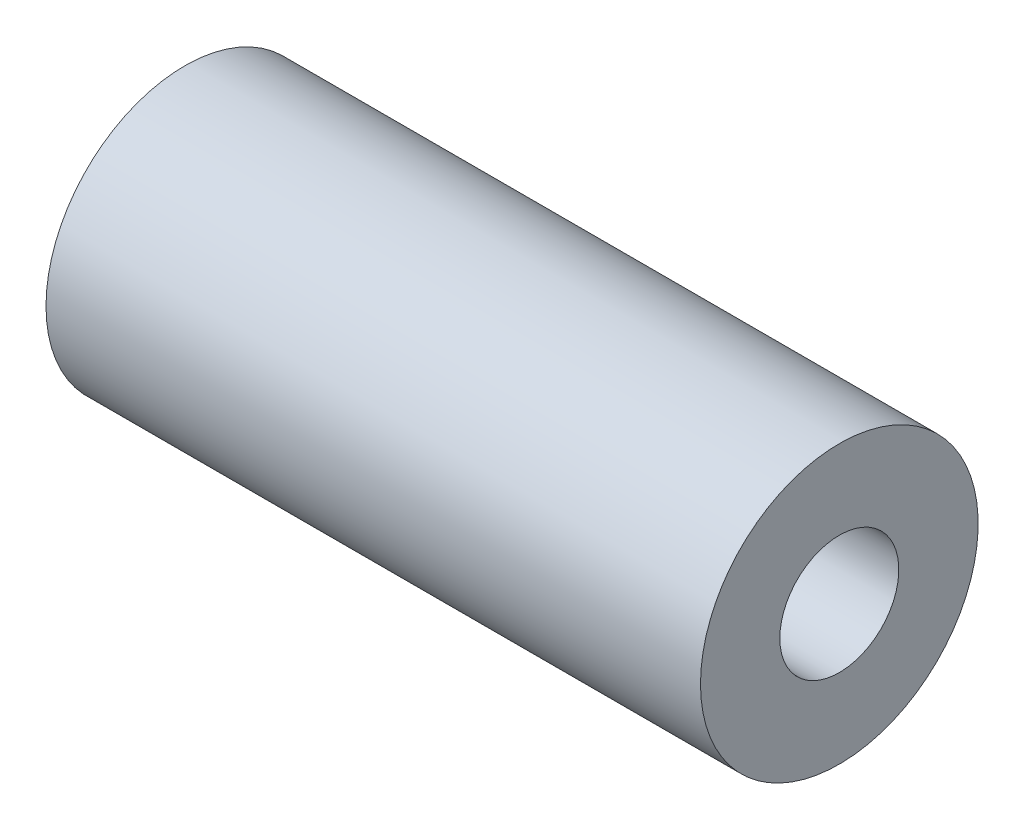
ISO-10303-21;
HEADER;
FILE_DESCRIPTION(('STEP AP214'),'2;1');
FILE_NAME('part.step','',(''),(''),'','','');
FILE_SCHEMA(('AUTOMOTIVE_DESIGN { 1 0 10303 214 1 1 1 1 }'));
ENDSEC;
DATA;
#1=APPLICATION_CONTEXT('core data for automotive mechanical design processes');
#2=APPLICATION_PROTOCOL_DEFINITION('international standard','automotive_design',2000,#1);
#3=PRODUCT_CONTEXT('',#1,'mechanical');
#4=PRODUCT('Part','Part','',(#3));
#5=PRODUCT_RELATED_PRODUCT_CATEGORY('part','',(#4));
#6=PRODUCT_DEFINITION_FORMATION('','',#4);
#7=PRODUCT_DEFINITION_CONTEXT('part definition',#1,'design');
#8=PRODUCT_DEFINITION('design','',#6,#7);
#9=PRODUCT_DEFINITION_SHAPE('','',#8);
#10=(LENGTH_UNIT() NAMED_UNIT(*) SI_UNIT(.MILLI.,.METRE.));
#11=(NAMED_UNIT(*) PLANE_ANGLE_UNIT() SI_UNIT($,.RADIAN.));
#12=(NAMED_UNIT(*) SI_UNIT($,.STERADIAN.) SOLID_ANGLE_UNIT());
#13=UNCERTAINTY_MEASURE_WITH_UNIT(LENGTH_MEASURE(1.E-05),#10,'distance_accuracy_value','');
#14=(GEOMETRIC_REPRESENTATION_CONTEXT(3) GLOBAL_UNCERTAINTY_ASSIGNED_CONTEXT((#13)) GLOBAL_UNIT_ASSIGNED_CONTEXT((#10,
#11,#12)) REPRESENTATION_CONTEXT('',''));
#15=CARTESIAN_POINT('',(0.,0.,0.));
#16=DIRECTION('',(0.,0.,1.));
#17=DIRECTION('',(1.,0.,0.));
#18=AXIS2_PLACEMENT_3D('',#15,#16,#17);
#19=CARTESIAN_POINT('',(-16.5,7.,0.));
#20=DIRECTION('',(1.,0.,0.));
#21=DIRECTION('',(0.,0.,-1.));
#22=AXIS2_PLACEMENT_3D('',#19,#20,#21);
#23=PLANE('',#22);
#24=CARTESIAN_POINT('',(-16.5,0.,0.));
#25=DIRECTION('',(-1.,0.,0.));
#26=DIRECTION('',(0.,0.,1.));
#27=AXIS2_PLACEMENT_3D('',#24,#25,#26);
#28=CIRCLE('',#27,3.);
#29=CARTESIAN_POINT('',(-16.5,0.,3.));
#30=VERTEX_POINT('',#29);
#31=EDGE_CURVE('E10',#30,#30,#28,.T.);
#32=ORIENTED_EDGE('',*,*,#31,.F.);
#33=EDGE_LOOP('',(#32));
#34=FACE_BOUND('',#33,.T.);
#35=CARTESIAN_POINT('',(-16.5,0.,0.));
#36=DIRECTION('',(-1.,0.,0.));
#37=DIRECTION('',(0.,0.,1.));
#38=AXIS2_PLACEMENT_3D('',#35,#36,#37);
#39=CIRCLE('',#38,7.);
#40=CARTESIAN_POINT('',(-16.5,0.,7.));
#41=VERTEX_POINT('',#40);
#42=EDGE_CURVE('E43',#41,#41,#39,.T.);
#43=ORIENTED_EDGE('',*,*,#42,.T.);
#44=EDGE_LOOP('',(#43));
#45=FACE_BOUND('',#44,.T.);
#46=ADVANCED_FACE('F29',(#34,#45),#23,.F.);
#47=CARTESIAN_POINT('',(-37.0031632185857,0.,0.));
#48=DIRECTION('',(-1.,0.,0.));
#49=DIRECTION('',(0.,0.,1.));
#50=AXIS2_PLACEMENT_3D('',#47,#48,#49);
#51=CYLINDRICAL_SURFACE('',#50,3.);
#52=CARTESIAN_POINT('',(16.5,0.,0.));
#53=DIRECTION('',(-1.,0.,0.));
#54=DIRECTION('',(0.,0.,1.));
#55=AXIS2_PLACEMENT_3D('',#52,#53,#54);
#56=CIRCLE('',#55,3.);
#57=CARTESIAN_POINT('',(16.5,0.,3.));
#58=VERTEX_POINT('',#57);
#59=EDGE_CURVE('E35',#58,#58,#56,.T.);
#60=ORIENTED_EDGE('',*,*,#59,.F.);
#61=EDGE_LOOP('',(#60));
#62=FACE_BOUND('',#61,.T.);
#63=ORIENTED_EDGE('',*,*,#31,.T.);
#64=EDGE_LOOP('',(#63));
#65=FACE_BOUND('',#64,.T.);
#66=ADVANCED_FACE('F58',(#62,#65),#51,.F.);
#67=CARTESIAN_POINT('',(16.5,7.,0.));
#68=DIRECTION('',(-1.,0.,0.));
#69=DIRECTION('',(0.,0.,1.));
#70=AXIS2_PLACEMENT_3D('',#67,#68,#69);
#71=PLANE('',#70);
#72=CARTESIAN_POINT('',(16.5,0.,0.));
#73=DIRECTION('',(-1.,0.,0.));
#74=DIRECTION('',(0.,0.,1.));
#75=AXIS2_PLACEMENT_3D('',#72,#73,#74);
#76=CIRCLE('',#75,7.);
#77=CARTESIAN_POINT('',(16.5,0.,7.));
#78=VERTEX_POINT('',#77);
#79=EDGE_CURVE('E39',#78,#78,#76,.T.);
#80=ORIENTED_EDGE('',*,*,#79,.F.);
#81=EDGE_LOOP('',(#80));
#82=FACE_BOUND('',#81,.T.);
#83=ORIENTED_EDGE('',*,*,#59,.T.);
#84=EDGE_LOOP('',(#83));
#85=FACE_BOUND('',#84,.T.);
#86=ADVANCED_FACE('F53',(#82,#85),#71,.F.);
#87=CARTESIAN_POINT('',(-37.0031632185857,0.,0.));
#88=DIRECTION('',(-1.,0.,0.));
#89=DIRECTION('',(0.,0.,1.));
#90=AXIS2_PLACEMENT_3D('',#87,#88,#89);
#91=CYLINDRICAL_SURFACE('',#90,7.);
#92=ORIENTED_EDGE('',*,*,#42,.F.);
#93=EDGE_LOOP('',(#92));
#94=FACE_BOUND('',#93,.T.);
#95=ORIENTED_EDGE('',*,*,#79,.T.);
#96=EDGE_LOOP('',(#95));
#97=FACE_BOUND('',#96,.T.);
#98=ADVANCED_FACE('F50',(#94,#97),#91,.T.);
#99=CLOSED_SHELL('',(#46,#66,#86,#98));
#100=MANIFOLD_SOLID_BREP('B2',#99);
#101=ADVANCED_BREP_SHAPE_REPRESENTATION('',(#18,#100),#14);
#102=SHAPE_DEFINITION_REPRESENTATION(#9,#101);
ENDSEC;
END-ISO-10303-21;
